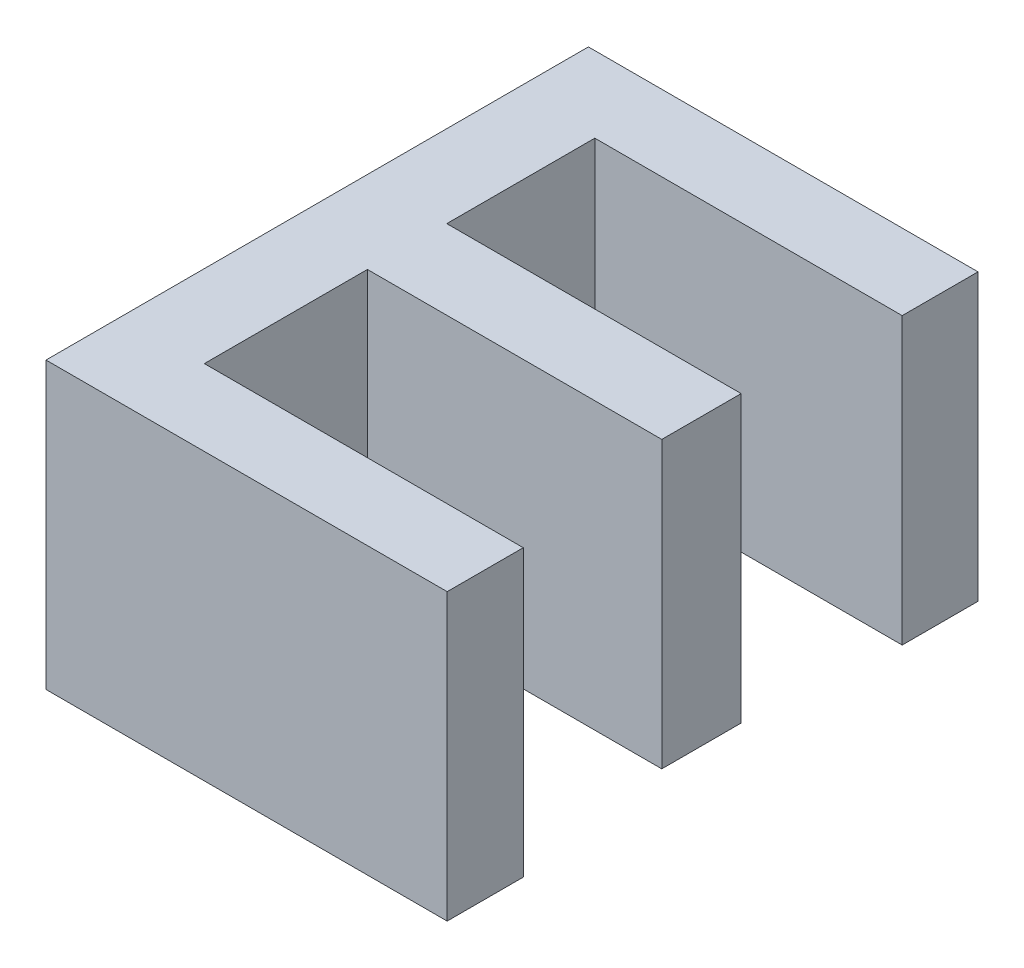
ISO-10303-21;
HEADER;
FILE_DESCRIPTION(('STEP AP214'),'2;1');
FILE_NAME('part.step','',(''),(''),'','','');
FILE_SCHEMA(('AUTOMOTIVE_DESIGN { 1 0 10303 214 1 1 1 1 }'));
ENDSEC;
DATA;
#1=APPLICATION_CONTEXT('core data for automotive mechanical design processes');
#2=APPLICATION_PROTOCOL_DEFINITION('international standard','automotive_design',2000,#1);
#3=PRODUCT_CONTEXT('',#1,'mechanical');
#4=PRODUCT('Part','Part','',(#3));
#5=PRODUCT_RELATED_PRODUCT_CATEGORY('part','',(#4));
#6=PRODUCT_DEFINITION_FORMATION('','',#4);
#7=PRODUCT_DEFINITION_CONTEXT('part definition',#1,'design');
#8=PRODUCT_DEFINITION('design','',#6,#7);
#9=PRODUCT_DEFINITION_SHAPE('','',#8);
#10=(LENGTH_UNIT() NAMED_UNIT(*) SI_UNIT(.MILLI.,.METRE.));
#11=(NAMED_UNIT(*) PLANE_ANGLE_UNIT() SI_UNIT($,.RADIAN.));
#12=(NAMED_UNIT(*) SI_UNIT($,.STERADIAN.) SOLID_ANGLE_UNIT());
#13=UNCERTAINTY_MEASURE_WITH_UNIT(LENGTH_MEASURE(1.E-05),#10,'distance_accuracy_value','');
#14=(GEOMETRIC_REPRESENTATION_CONTEXT(3) GLOBAL_UNCERTAINTY_ASSIGNED_CONTEXT((#13)) GLOBAL_UNIT_ASSIGNED_CONTEXT((#10,
#11,#12)) REPRESENTATION_CONTEXT('',''));
#15=CARTESIAN_POINT('',(0.,0.,0.));
#16=DIRECTION('',(0.,0.,1.));
#17=DIRECTION('',(1.,0.,0.));
#18=AXIS2_PLACEMENT_3D('',#15,#16,#17);
#19=CARTESIAN_POINT('',(212.078840541625,10.,-58.9556493619376));
#20=DIRECTION('',(-1.,0.,0.));
#21=DIRECTION('',(0.,0.,1.));
#22=AXIS2_PLACEMENT_3D('',#19,#20,#21);
#23=PLANE('',#22);
#24=DIRECTION('',(0.,0.,-1.));
#25=VECTOR('',#24,1.);
#26=CARTESIAN_POINT('',(212.078840541625,0.,-58.9556493619376));
#27=LINE('',#26,#25);
#28=CARTESIAN_POINT('',(212.078840541625,0.,-56.28859622837));
#29=VERTEX_POINT('',#28);
#30=CARTESIAN_POINT('',(212.078840541625,0.,-58.9556493619376));
#31=VERTEX_POINT('',#30);
#32=EDGE_CURVE('E150',#29,#31,#27,.T.);
#33=ORIENTED_EDGE('',*,*,#32,.T.);
#34=DIRECTION('',(0.,-1.,0.));
#35=VECTOR('',#34,1.);
#36=CARTESIAN_POINT('',(212.078840541625,10.,-58.9556493619376));
#37=LINE('',#36,#35);
#38=CARTESIAN_POINT('',(212.078840541625,10.,-58.9556493619376));
#39=VERTEX_POINT('',#38);
#40=EDGE_CURVE('E11',#39,#31,#37,.T.);
#41=ORIENTED_EDGE('',*,*,#40,.F.);
#42=DIRECTION('',(0.,0.,-1.));
#43=VECTOR('',#42,1.);
#44=CARTESIAN_POINT('',(212.078840541625,10.,-58.9556493619376));
#45=LINE('',#44,#43);
#46=CARTESIAN_POINT('',(212.078840541625,10.,-56.28859622837));
#47=VERTEX_POINT('',#46);
#48=EDGE_CURVE('E172',#47,#39,#45,.T.);
#49=ORIENTED_EDGE('',*,*,#48,.F.);
#50=DIRECTION('',(0.,-1.,0.));
#51=VECTOR('',#50,1.);
#52=CARTESIAN_POINT('',(212.078840541625,10.,-56.28859622837));
#53=LINE('',#52,#51);
#54=EDGE_CURVE('E146',#47,#29,#53,.T.);
#55=ORIENTED_EDGE('',*,*,#54,.T.);
#56=EDGE_LOOP('',(#33,#41,#49,#55));
#57=FACE_BOUND('',#56,.T.);
#58=ADVANCED_FACE('F30',(#57),#23,.F.);
#59=CARTESIAN_POINT('',(200.901912577898,10.,-58.9556493619376));
#60=DIRECTION('',(0.,0.,1.));
#61=DIRECTION('',(1.,0.,0.));
#62=AXIS2_PLACEMENT_3D('',#59,#60,#61);
#63=PLANE('',#62);
#64=DIRECTION('',(-1.,0.,0.));
#65=VECTOR('',#64,1.);
#66=CARTESIAN_POINT('',(200.901912577898,0.,-58.9556493619376));
#67=LINE('',#66,#65);
#68=CARTESIAN_POINT('',(200.901912577898,0.,-58.9556493619376));
#69=VERTEX_POINT('',#68);
#70=EDGE_CURVE('E153',#31,#69,#67,.T.);
#71=ORIENTED_EDGE('',*,*,#70,.T.);
#72=DIRECTION('',(0.,-1.,0.));
#73=VECTOR('',#72,1.);
#74=CARTESIAN_POINT('',(200.901912577898,10.,-58.9556493619376));
#75=LINE('',#74,#73);
#76=CARTESIAN_POINT('',(200.901912577898,10.,-58.9556493619376));
#77=VERTEX_POINT('',#76);
#78=EDGE_CURVE('E38',#77,#69,#75,.T.);
#79=ORIENTED_EDGE('',*,*,#78,.F.);
#80=DIRECTION('',(-1.,0.,0.));
#81=VECTOR('',#80,1.);
#82=CARTESIAN_POINT('',(200.901912577898,10.,-58.9556493619376));
#83=LINE('',#82,#81);
#84=EDGE_CURVE('E101',#39,#77,#83,.T.);
#85=ORIENTED_EDGE('',*,*,#84,.F.);
#86=ORIENTED_EDGE('',*,*,#40,.T.);
#87=EDGE_LOOP('',(#71,#79,#85,#86));
#88=FACE_BOUND('',#87,.T.);
#89=ADVANCED_FACE('F250',(#88),#63,.F.);
#90=CARTESIAN_POINT('',(200.901912577898,10.,-64.6705491804947));
#91=DIRECTION('',(-1.,0.,0.));
#92=DIRECTION('',(0.,0.,1.));
#93=AXIS2_PLACEMENT_3D('',#90,#91,#92);
#94=PLANE('',#93);
#95=DIRECTION('',(0.,0.,-1.));
#96=VECTOR('',#95,1.);
#97=CARTESIAN_POINT('',(200.901912577898,0.,-64.6705491804947));
#98=LINE('',#97,#96);
#99=CARTESIAN_POINT('',(200.901912577898,0.,-64.6705491804947));
#100=VERTEX_POINT('',#99);
#101=EDGE_CURVE('E155',#69,#100,#98,.T.);
#102=ORIENTED_EDGE('',*,*,#101,.T.);
#103=DIRECTION('',(0.,-1.,0.));
#104=VECTOR('',#103,1.);
#105=CARTESIAN_POINT('',(200.901912577898,10.,-64.6705491804947));
#106=LINE('',#105,#104);
#107=CARTESIAN_POINT('',(200.901912577898,10.,-64.6705491804947));
#108=VERTEX_POINT('',#107);
#109=EDGE_CURVE('E191',#108,#100,#106,.T.);
#110=ORIENTED_EDGE('',*,*,#109,.F.);
#111=DIRECTION('',(0.,0.,-1.));
#112=VECTOR('',#111,1.);
#113=CARTESIAN_POINT('',(200.901912577898,10.,-64.6705491804947));
#114=LINE('',#113,#112);
#115=EDGE_CURVE('E199',#77,#108,#114,.T.);
#116=ORIENTED_EDGE('',*,*,#115,.F.);
#117=ORIENTED_EDGE('',*,*,#78,.T.);
#118=EDGE_LOOP('',(#102,#110,#116,#117));
#119=FACE_BOUND('',#118,.T.);
#120=ADVANCED_FACE('F197',(#119),#94,.F.);
#121=CARTESIAN_POINT('',(211.219076852107,10.,-64.6705491804947));
#122=DIRECTION('',(0.,0.,-1.));
#123=DIRECTION('',(-1.,0.,0.));
#124=AXIS2_PLACEMENT_3D('',#121,#122,#123);
#125=PLANE('',#124);
#126=DIRECTION('',(1.,0.,0.));
#127=VECTOR('',#126,1.);
#128=CARTESIAN_POINT('',(211.219076852107,0.,-64.6705491804947));
#129=LINE('',#128,#127);
#130=CARTESIAN_POINT('',(211.219076852107,0.,-64.6705491804947));
#131=VERTEX_POINT('',#130);
#132=EDGE_CURVE('E157',#100,#131,#129,.T.);
#133=ORIENTED_EDGE('',*,*,#132,.T.);
#134=DIRECTION('',(0.,-1.,0.));
#135=VECTOR('',#134,1.);
#136=CARTESIAN_POINT('',(211.219076852107,10.,-64.6705491804947));
#137=LINE('',#136,#135);
#138=CARTESIAN_POINT('',(211.219076852107,10.,-64.6705491804947));
#139=VERTEX_POINT('',#138);
#140=EDGE_CURVE('E188',#139,#131,#137,.T.);
#141=ORIENTED_EDGE('',*,*,#140,.F.);
#142=DIRECTION('',(1.,0.,0.));
#143=VECTOR('',#142,1.);
#144=CARTESIAN_POINT('',(211.219076852107,10.,-64.6705491804947));
#145=LINE('',#144,#143);
#146=EDGE_CURVE('E217',#108,#139,#145,.T.);
#147=ORIENTED_EDGE('',*,*,#146,.F.);
#148=ORIENTED_EDGE('',*,*,#109,.T.);
#149=EDGE_LOOP('',(#133,#141,#147,#148));
#150=FACE_BOUND('',#149,.T.);
#151=ADVANCED_FACE('F208',(#150),#125,.F.);
#152=CARTESIAN_POINT('',(211.219076852107,10.,-67.452137587757));
#153=DIRECTION('',(-1.,0.,0.));
#154=DIRECTION('',(0.,0.,1.));
#155=AXIS2_PLACEMENT_3D('',#152,#153,#154);
#156=PLANE('',#155);
#157=DIRECTION('',(0.,0.,-1.));
#158=VECTOR('',#157,1.);
#159=CARTESIAN_POINT('',(211.219076852107,0.,-67.452137587757));
#160=LINE('',#159,#158);
#161=CARTESIAN_POINT('',(211.219076852107,0.,-67.452137587757));
#162=VERTEX_POINT('',#161);
#163=EDGE_CURVE('E159',#131,#162,#160,.T.);
#164=ORIENTED_EDGE('',*,*,#163,.T.);
#165=DIRECTION('',(0.,-1.,0.));
#166=VECTOR('',#165,1.);
#167=CARTESIAN_POINT('',(211.219076852107,10.,-67.452137587757));
#168=LINE('',#167,#166);
#169=CARTESIAN_POINT('',(211.219076852107,10.,-67.452137587757));
#170=VERTEX_POINT('',#169);
#171=EDGE_CURVE('E185',#170,#162,#168,.T.);
#172=ORIENTED_EDGE('',*,*,#171,.F.);
#173=DIRECTION('',(0.,0.,-1.));
#174=VECTOR('',#173,1.);
#175=CARTESIAN_POINT('',(211.219076852107,10.,-67.452137587757));
#176=LINE('',#175,#174);
#177=EDGE_CURVE('E214',#139,#170,#176,.T.);
#178=ORIENTED_EDGE('',*,*,#177,.F.);
#179=ORIENTED_EDGE('',*,*,#140,.T.);
#180=EDGE_LOOP('',(#164,#172,#178,#179));
#181=FACE_BOUND('',#180,.T.);
#182=ADVANCED_FACE('F212',(#181),#156,.F.);
#183=CARTESIAN_POINT('',(200.901912577898,10.,-67.452137587757));
#184=DIRECTION('',(0.,0.,1.));
#185=DIRECTION('',(1.,0.,0.));
#186=AXIS2_PLACEMENT_3D('',#183,#184,#185);
#187=PLANE('',#186);
#188=DIRECTION('',(-1.,0.,0.));
#189=VECTOR('',#188,1.);
#190=CARTESIAN_POINT('',(200.901912577898,0.,-67.452137587757));
#191=LINE('',#190,#189);
#192=CARTESIAN_POINT('',(200.901912577898,0.,-67.452137587757));
#193=VERTEX_POINT('',#192);
#194=EDGE_CURVE('E161',#162,#193,#191,.T.);
#195=ORIENTED_EDGE('',*,*,#194,.T.);
#196=DIRECTION('',(0.,-1.,0.));
#197=VECTOR('',#196,1.);
#198=CARTESIAN_POINT('',(200.901912577898,10.,-67.452137587757));
#199=LINE('',#198,#197);
#200=CARTESIAN_POINT('',(200.901912577898,10.,-67.452137587757));
#201=VERTEX_POINT('',#200);
#202=EDGE_CURVE('E182',#201,#193,#199,.T.);
#203=ORIENTED_EDGE('',*,*,#202,.F.);
#204=DIRECTION('',(-1.,0.,0.));
#205=VECTOR('',#204,1.);
#206=CARTESIAN_POINT('',(200.901912577898,10.,-67.452137587757));
#207=LINE('',#206,#205);
#208=EDGE_CURVE('E216',#170,#201,#207,.T.);
#209=ORIENTED_EDGE('',*,*,#208,.F.);
#210=ORIENTED_EDGE('',*,*,#171,.T.);
#211=EDGE_LOOP('',(#195,#203,#209,#210));
#212=FACE_BOUND('',#211,.T.);
#213=ADVANCED_FACE('F263',(#212),#187,.F.);
#214=CARTESIAN_POINT('',(200.901912577898,10.,-72.6404550002934));
#215=DIRECTION('',(-1.,0.,0.));
#216=DIRECTION('',(0.,0.,1.));
#217=AXIS2_PLACEMENT_3D('',#214,#215,#216);
#218=PLANE('',#217);
#219=DIRECTION('',(0.,0.,-1.));
#220=VECTOR('',#219,1.);
#221=CARTESIAN_POINT('',(200.901912577898,0.,-72.6404550002934));
#222=LINE('',#221,#220);
#223=CARTESIAN_POINT('',(200.901912577898,0.,-72.6404550002934));
#224=VERTEX_POINT('',#223);
#225=EDGE_CURVE('E163',#193,#224,#222,.T.);
#226=ORIENTED_EDGE('',*,*,#225,.T.);
#227=DIRECTION('',(0.,-1.,0.));
#228=VECTOR('',#227,1.);
#229=CARTESIAN_POINT('',(200.901912577898,10.,-72.6404550002934));
#230=LINE('',#229,#228);
#231=CARTESIAN_POINT('',(200.901912577898,10.,-72.6404550002934));
#232=VERTEX_POINT('',#231);
#233=EDGE_CURVE('E179',#232,#224,#230,.T.);
#234=ORIENTED_EDGE('',*,*,#233,.F.);
#235=DIRECTION('',(0.,0.,-1.));
#236=VECTOR('',#235,1.);
#237=CARTESIAN_POINT('',(200.901912577898,10.,-72.6404550002934));
#238=LINE('',#237,#236);
#239=EDGE_CURVE('E219',#201,#232,#238,.T.);
#240=ORIENTED_EDGE('',*,*,#239,.F.);
#241=ORIENTED_EDGE('',*,*,#202,.T.);
#242=EDGE_LOOP('',(#226,#234,#240,#241));
#243=FACE_BOUND('',#242,.T.);
#244=ADVANCED_FACE('F266',(#243),#218,.F.);
#245=CARTESIAN_POINT('',(211.674245864204,10.,-72.6404550002934));
#246=DIRECTION('',(0.,0.,-1.));
#247=DIRECTION('',(-1.,0.,0.));
#248=AXIS2_PLACEMENT_3D('',#245,#246,#247);
#249=PLANE('',#248);
#250=DIRECTION('',(1.,0.,0.));
#251=VECTOR('',#250,1.);
#252=CARTESIAN_POINT('',(211.674245864204,0.,-72.6404550002934));
#253=LINE('',#252,#251);
#254=CARTESIAN_POINT('',(211.674245864204,0.,-72.6404550002934));
#255=VERTEX_POINT('',#254);
#256=EDGE_CURVE('E165',#224,#255,#253,.T.);
#257=ORIENTED_EDGE('',*,*,#256,.T.);
#258=DIRECTION('',(0.,-1.,0.));
#259=VECTOR('',#258,1.);
#260=CARTESIAN_POINT('',(211.674245864204,10.,-72.6404550002934));
#261=LINE('',#260,#259);
#262=CARTESIAN_POINT('',(211.674245864204,10.,-72.6404550002934));
#263=VERTEX_POINT('',#262);
#264=EDGE_CURVE('E176',#263,#255,#261,.T.);
#265=ORIENTED_EDGE('',*,*,#264,.F.);
#266=DIRECTION('',(1.,0.,0.));
#267=VECTOR('',#266,1.);
#268=CARTESIAN_POINT('',(211.674245864204,10.,-72.6404550002934));
#269=LINE('',#268,#267);
#270=EDGE_CURVE('E225',#232,#263,#269,.T.);
#271=ORIENTED_EDGE('',*,*,#270,.F.);
#272=ORIENTED_EDGE('',*,*,#233,.T.);
#273=EDGE_LOOP('',(#257,#265,#271,#272));
#274=FACE_BOUND('',#273,.T.);
#275=ADVANCED_FACE('F231',(#274),#249,.F.);
#276=CARTESIAN_POINT('',(211.674245864204,10.,-75.2974570796293));
#277=DIRECTION('',(-1.,0.,0.));
#278=DIRECTION('',(0.,0.,1.));
#279=AXIS2_PLACEMENT_3D('',#276,#277,#278);
#280=PLANE('',#279);
#281=DIRECTION('',(0.,0.,-1.));
#282=VECTOR('',#281,1.);
#283=CARTESIAN_POINT('',(211.674245864204,0.,-75.2974570796293));
#284=LINE('',#283,#282);
#285=CARTESIAN_POINT('',(211.674245864204,0.,-75.2974570796293));
#286=VERTEX_POINT('',#285);
#287=EDGE_CURVE('E167',#255,#286,#284,.T.);
#288=ORIENTED_EDGE('',*,*,#287,.T.);
#289=DIRECTION('',(0.,-1.,0.));
#290=VECTOR('',#289,1.);
#291=CARTESIAN_POINT('',(211.674245864204,10.,-75.2974570796293));
#292=LINE('',#291,#290);
#293=CARTESIAN_POINT('',(211.674245864204,10.,-75.2974570796293));
#294=VERTEX_POINT('',#293);
#295=EDGE_CURVE('E141',#294,#286,#292,.T.);
#296=ORIENTED_EDGE('',*,*,#295,.F.);
#297=DIRECTION('',(0.,0.,-1.));
#298=VECTOR('',#297,1.);
#299=CARTESIAN_POINT('',(211.674245864204,10.,-75.2974570796293));
#300=LINE('',#299,#298);
#301=EDGE_CURVE('E132',#263,#294,#300,.T.);
#302=ORIENTED_EDGE('',*,*,#301,.F.);
#303=ORIENTED_EDGE('',*,*,#264,.T.);
#304=EDGE_LOOP('',(#288,#296,#302,#303));
#305=FACE_BOUND('',#304,.T.);
#306=ADVANCED_FACE('F235',(#305),#280,.F.);
#307=CARTESIAN_POINT('',(198.019175501281,10.,-75.2974570796293));
#308=DIRECTION('',(0.,0.,1.));
#309=DIRECTION('',(1.,0.,0.));
#310=AXIS2_PLACEMENT_3D('',#307,#308,#309);
#311=PLANE('',#310);
#312=DIRECTION('',(-1.,0.,0.));
#313=VECTOR('',#312,1.);
#314=CARTESIAN_POINT('',(198.019175501281,0.,-75.2974570796293));
#315=LINE('',#314,#313);
#316=CARTESIAN_POINT('',(198.019175501281,0.,-75.2974570796293));
#317=VERTEX_POINT('',#316);
#318=EDGE_CURVE('E140',#286,#317,#315,.T.);
#319=ORIENTED_EDGE('',*,*,#318,.T.);
#320=DIRECTION('',(0.,-1.,0.));
#321=VECTOR('',#320,1.);
#322=CARTESIAN_POINT('',(198.019175501281,10.,-75.2974570796293));
#323=LINE('',#322,#321);
#324=CARTESIAN_POINT('',(198.019175501281,10.,-75.2974570796293));
#325=VERTEX_POINT('',#324);
#326=EDGE_CURVE('E137',#325,#317,#323,.T.);
#327=ORIENTED_EDGE('',*,*,#326,.F.);
#328=DIRECTION('',(-1.,0.,0.));
#329=VECTOR('',#328,1.);
#330=CARTESIAN_POINT('',(198.019175501281,10.,-75.2974570796293));
#331=LINE('',#330,#329);
#332=EDGE_CURVE('E126',#294,#325,#331,.T.);
#333=ORIENTED_EDGE('',*,*,#332,.F.);
#334=ORIENTED_EDGE('',*,*,#295,.T.);
#335=EDGE_LOOP('',(#319,#327,#333,#334));
#336=FACE_BOUND('',#335,.T.);
#337=ADVANCED_FACE('F138',(#336),#311,.F.);
#338=CARTESIAN_POINT('',(198.019175501281,10.,-56.28859622837));
#339=DIRECTION('',(1.,0.,0.));
#340=DIRECTION('',(0.,0.,-1.));
#341=AXIS2_PLACEMENT_3D('',#338,#339,#340);
#342=PLANE('',#341);
#343=DIRECTION('',(0.,0.,1.));
#344=VECTOR('',#343,1.);
#345=CARTESIAN_POINT('',(198.019175501281,0.,-56.28859622837));
#346=LINE('',#345,#344);
#347=CARTESIAN_POINT('',(198.019175501281,0.,-56.28859622837));
#348=VERTEX_POINT('',#347);
#349=EDGE_CURVE('E87',#317,#348,#346,.T.);
#350=ORIENTED_EDGE('',*,*,#349,.T.);
#351=DIRECTION('',(0.,-1.,0.));
#352=VECTOR('',#351,1.);
#353=CARTESIAN_POINT('',(198.019175501281,10.,-56.28859622837));
#354=LINE('',#353,#352);
#355=CARTESIAN_POINT('',(198.019175501281,10.,-56.28859622837));
#356=VERTEX_POINT('',#355);
#357=EDGE_CURVE('E142',#356,#348,#354,.T.);
#358=ORIENTED_EDGE('',*,*,#357,.F.);
#359=DIRECTION('',(0.,0.,1.));
#360=VECTOR('',#359,1.);
#361=CARTESIAN_POINT('',(198.019175501281,10.,-56.28859622837));
#362=LINE('',#361,#360);
#363=EDGE_CURVE('E130',#325,#356,#362,.T.);
#364=ORIENTED_EDGE('',*,*,#363,.F.);
#365=ORIENTED_EDGE('',*,*,#326,.T.);
#366=EDGE_LOOP('',(#350,#358,#364,#365));
#367=FACE_BOUND('',#366,.T.);
#368=ADVANCED_FACE('F144',(#367),#342,.F.);
#369=CARTESIAN_POINT('',(212.078840541625,10.,-56.28859622837));
#370=DIRECTION('',(0.,0.,-1.));
#371=DIRECTION('',(-1.,0.,0.));
#372=AXIS2_PLACEMENT_3D('',#369,#370,#371);
#373=PLANE('',#372);
#374=DIRECTION('',(1.,0.,0.));
#375=VECTOR('',#374,1.);
#376=CARTESIAN_POINT('',(212.078840541625,0.,-56.28859622837));
#377=LINE('',#376,#375);
#378=EDGE_CURVE('E93',#348,#29,#377,.T.);
#379=ORIENTED_EDGE('',*,*,#378,.T.);
#380=ORIENTED_EDGE('',*,*,#54,.F.);
#381=DIRECTION('',(1.,0.,0.));
#382=VECTOR('',#381,1.);
#383=CARTESIAN_POINT('',(212.078840541625,10.,-56.28859622837));
#384=LINE('',#383,#382);
#385=EDGE_CURVE('E46',#356,#47,#384,.T.);
#386=ORIENTED_EDGE('',*,*,#385,.F.);
#387=ORIENTED_EDGE('',*,*,#357,.T.);
#388=EDGE_LOOP('',(#379,#380,#386,#387));
#389=FACE_BOUND('',#388,.T.);
#390=ADVANCED_FACE('F239',(#389),#373,.F.);
#391=CARTESIAN_POINT('',(0.,10.,0.));
#392=DIRECTION('',(0.,-1.,0.));
#393=DIRECTION('',(0.,0.,-1.));
#394=AXIS2_PLACEMENT_3D('',#391,#392,#393);
#395=PLANE('',#394);
#396=ORIENTED_EDGE('',*,*,#48,.T.);
#397=ORIENTED_EDGE('',*,*,#84,.T.);
#398=ORIENTED_EDGE('',*,*,#115,.T.);
#399=ORIENTED_EDGE('',*,*,#146,.T.);
#400=ORIENTED_EDGE('',*,*,#177,.T.);
#401=ORIENTED_EDGE('',*,*,#208,.T.);
#402=ORIENTED_EDGE('',*,*,#239,.T.);
#403=ORIENTED_EDGE('',*,*,#270,.T.);
#404=ORIENTED_EDGE('',*,*,#301,.T.);
#405=ORIENTED_EDGE('',*,*,#332,.T.);
#406=ORIENTED_EDGE('',*,*,#363,.T.);
#407=ORIENTED_EDGE('',*,*,#385,.T.);
#408=EDGE_LOOP('',(#396,#397,#398,#399,#400,#401,#402,#403,#404,#405,#406,#407));
#409=FACE_BOUND('',#408,.T.);
#410=ADVANCED_FACE('F128',(#409),#395,.F.);
#411=CARTESIAN_POINT('',(0.,0.,0.));
#412=DIRECTION('',(0.,-1.,0.));
#413=DIRECTION('',(0.,0.,-1.));
#414=AXIS2_PLACEMENT_3D('',#411,#412,#413);
#415=PLANE('',#414);
#416=ORIENTED_EDGE('',*,*,#32,.F.);
#417=ORIENTED_EDGE('',*,*,#378,.F.);
#418=ORIENTED_EDGE('',*,*,#349,.F.);
#419=ORIENTED_EDGE('',*,*,#318,.F.);
#420=ORIENTED_EDGE('',*,*,#287,.F.);
#421=ORIENTED_EDGE('',*,*,#256,.F.);
#422=ORIENTED_EDGE('',*,*,#225,.F.);
#423=ORIENTED_EDGE('',*,*,#194,.F.);
#424=ORIENTED_EDGE('',*,*,#163,.F.);
#425=ORIENTED_EDGE('',*,*,#132,.F.);
#426=ORIENTED_EDGE('',*,*,#101,.F.);
#427=ORIENTED_EDGE('',*,*,#70,.F.);
#428=EDGE_LOOP('',(#416,#417,#418,#419,#420,#421,#422,#423,#424,#425,#426,#427));
#429=FACE_BOUND('',#428,.T.);
#430=ADVANCED_FACE('F203',(#429),#415,.T.);
#431=CLOSED_SHELL('',(#58,#89,#120,#151,#182,#213,#244,#275,#306,#337,#368,#390,#410,#430));
#432=MANIFOLD_SOLID_BREP('B2',#431);
#433=ADVANCED_BREP_SHAPE_REPRESENTATION('',(#18,#432),#14);
#434=SHAPE_DEFINITION_REPRESENTATION(#9,#433);
ENDSEC;
END-ISO-10303-21;
